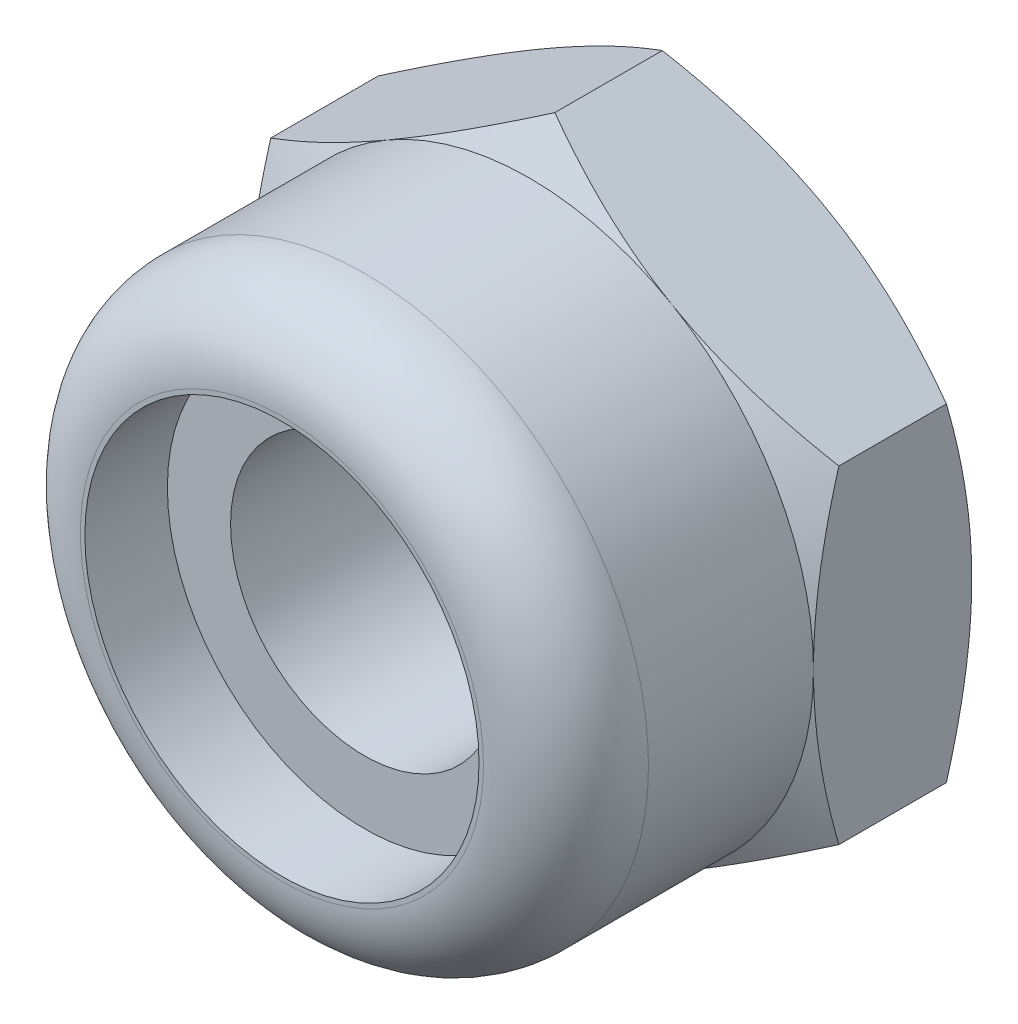
ISO-10303-21;
HEADER;
FILE_DESCRIPTION(('STEP AP214'),'2;1');
FILE_NAME('part.step','',(''),(''),'','','');
FILE_SCHEMA(('AUTOMOTIVE_DESIGN { 1 0 10303 214 1 1 1 1 }'));
ENDSEC;
DATA;
#1=APPLICATION_CONTEXT('core data for automotive mechanical design processes');
#2=APPLICATION_PROTOCOL_DEFINITION('international standard','automotive_design',2000,#1);
#3=PRODUCT_CONTEXT('',#1,'mechanical');
#4=PRODUCT('Part','Part','',(#3));
#5=PRODUCT_RELATED_PRODUCT_CATEGORY('part','',(#4));
#6=PRODUCT_DEFINITION_FORMATION('','',#4);
#7=PRODUCT_DEFINITION_CONTEXT('part definition',#1,'design');
#8=PRODUCT_DEFINITION('design','',#6,#7);
#9=PRODUCT_DEFINITION_SHAPE('','',#8);
#10=(LENGTH_UNIT() NAMED_UNIT(*) SI_UNIT(.MILLI.,.METRE.));
#11=(NAMED_UNIT(*) PLANE_ANGLE_UNIT() SI_UNIT($,.RADIAN.));
#12=(NAMED_UNIT(*) SI_UNIT($,.STERADIAN.) SOLID_ANGLE_UNIT());
#13=UNCERTAINTY_MEASURE_WITH_UNIT(LENGTH_MEASURE(1.E-05),#10,'distance_accuracy_value','');
#14=(GEOMETRIC_REPRESENTATION_CONTEXT(3) GLOBAL_UNCERTAINTY_ASSIGNED_CONTEXT((#13)) GLOBAL_UNIT_ASSIGNED_CONTEXT((#10,
#11,#12)) REPRESENTATION_CONTEXT('',''));
#15=CARTESIAN_POINT('',(0.,0.,0.));
#16=DIRECTION('',(0.,0.,1.));
#17=DIRECTION('',(1.,0.,0.));
#18=AXIS2_PLACEMENT_3D('',#15,#16,#17);
#19=CARTESIAN_POINT('',(0.,0.,-1.95));
#20=DIRECTION('',(0.,0.,1.));
#21=DIRECTION('',(1.,0.,0.));
#22=AXIS2_PLACEMENT_3D('',#19,#20,#21);
#23=CYLINDRICAL_SURFACE('',#22,1.65);
#24=CARTESIAN_POINT('',(0.,0.,2.03333333333333));
#25=DIRECTION('',(0.,0.,1.));
#26=DIRECTION('',(1.,0.,0.));
#27=AXIS2_PLACEMENT_3D('',#24,#25,#26);
#28=CIRCLE('',#27,1.65);
#29=CARTESIAN_POINT('',(1.65,0.,2.03333333333333));
#30=VERTEX_POINT('',#29);
#31=EDGE_CURVE('E263',#30,#30,#28,.T.);
#32=ORIENTED_EDGE('',*,*,#31,.T.);
#33=EDGE_LOOP('',(#32));
#34=FACE_BOUND('',#33,.T.);
#35=CARTESIAN_POINT('',(0.,0.,-1.67952736162661));
#36=DIRECTION('',(0.,0.,-1.));
#37=DIRECTION('',(-1.,0.,0.));
#38=AXIS2_PLACEMENT_3D('',#35,#36,#37);
#39=CIRCLE('',#38,1.65);
#40=CARTESIAN_POINT('',(-1.65,0.,-1.67952736162661));
#41=VERTEX_POINT('',#40);
#42=EDGE_CURVE('E22',#41,#41,#39,.F.);
#43=ORIENTED_EDGE('',*,*,#42,.F.);
#44=EDGE_LOOP('',(#43));
#45=FACE_BOUND('',#44,.T.);
#46=ADVANCED_FACE('F17',(#34,#45),#23,.F.);
#47=CARTESIAN_POINT('',(0.,4.04145188432739,-1.95));
#48=DIRECTION('',(-0.5,0.866025403784437,0.));
#49=DIRECTION('',(-0.866025403784437,-0.5,0.));
#50=AXIS2_PLACEMENT_3D('',#47,#48,#49);
#51=PLANE('',#50);
#52=DIRECTION('',(0.,0.,1.));
#53=VECTOR('',#52,1.);
#54=CARTESIAN_POINT('',(-3.5,2.02072594216368,-1.95));
#55=LINE('',#54,#53);
#56=CARTESIAN_POINT('',(-3.5,2.02072594216372,-1.63739260883035));
#57=VERTEX_POINT('',#56);
#58=CARTESIAN_POINT('',(-3.5,2.02072594216368,-0.312607391169641));
#59=VERTEX_POINT('',#58);
#60=EDGE_CURVE('E236',#57,#59,#55,.T.);
#61=ORIENTED_EDGE('',*,*,#60,.T.);
#62=CARTESIAN_POINT('',(-3.5002,2.02061047210984,-0.312674060693369));
#63=CARTESIAN_POINT('',(-3.34639282154755,2.10941108799267,-0.261385788989985));
#64=CARTESIAN_POINT('',(-3.19125798916558,2.19897822522909,-0.2147409538162));
#65=CARTESIAN_POINT('',(-2.87830199342322,2.37966345361545,-0.133321875533353));
#66=CARTESIAN_POINT('',(-2.72047526921251,2.47078475532382,-0.0985764355845646));
#67=CARTESIAN_POINT('',(-2.40677778961988,2.65189807961074,-0.0444900271828394));
#68=CARTESIAN_POINT('',(-2.25095530083932,2.741862235454,-0.0247890862603857));
#69=CARTESIAN_POINT('',(-1.93857711279463,2.92221386641056,-0.0012701327372566));
#70=CARTESIAN_POINT('',(-1.78202254896577,3.01260068598001,0.00256735545443518));
#71=CARTESIAN_POINT('',(-1.48949078007901,3.18149398149329,-0.00541530187697774));
#72=CARTESIAN_POINT('',(-1.3534697875421,3.26002573814993,-0.0152754340696097));
#73=CARTESIAN_POINT('',(-1.08231397971101,3.41657761679354,-0.0465264668994083));
#74=CARTESIAN_POINT('',(-0.947180102315319,3.49459719728458,-0.0679280432858025));
#75=CARTESIAN_POINT('',(-0.675465207594815,3.6514718648943,-0.121430407880582));
#76=CARTESIAN_POINT('',(-0.538918580721662,3.73030709667645,-0.153757994445092));
#77=CARTESIAN_POINT('',(-0.267861907055493,3.88680174018325,-0.227128933808001));
#78=CARTESIAN_POINT('',(-0.133348387531457,3.9644631568901,-0.268155046569875));
#79=CARTESIAN_POINT('',(0.000200000000009139,4.04156735438123,-0.312674060693379));
#80=B_SPLINE_CURVE_WITH_KNOTS('',3,(#62,#63,#64,#65,#66,#67,#68,#69,#70,#71,#72,#73,#74,#75,#76,
#77,#78,#79),.UNSPECIFIED.,.F.,.F.,(4,2,2,2,2,2,2,2,4),(0.,0.554793832886253,1.11092123814984,
1.65328467083218,2.19498204478403,2.6666513085086,3.13875761298268,3.62133612600511,
4.10296698719189),.UNSPECIFIED.);
#81=CARTESIAN_POINT('',(-1.75,3.03108891324553,0.));
#82=VERTEX_POINT('',#81);
#83=EDGE_CURVE('E42',#59,#82,#80,.T.);
#84=ORIENTED_EDGE('',*,*,#83,.T.);
#85=CARTESIAN_POINT('',(0.,4.04145188432739,-0.312607391169652));
#86=VERTEX_POINT('',#85);
#87=EDGE_CURVE('E185',#82,#86,#80,.T.);
#88=ORIENTED_EDGE('',*,*,#87,.T.);
#89=DIRECTION('',(0.,0.,1.));
#90=VECTOR('',#89,1.);
#91=CARTESIAN_POINT('',(0.,4.04145188432739,-1.95));
#92=LINE('',#91,#90);
#93=CARTESIAN_POINT('',(0.,4.04145188432739,-1.63739260883035));
#94=VERTEX_POINT('',#93);
#95=EDGE_CURVE('E222',#94,#86,#92,.T.);
#96=ORIENTED_EDGE('',*,*,#95,.F.);
#97=CARTESIAN_POINT('',(-3.5002,2.02061047210984,-1.63732593930663));
#98=CARTESIAN_POINT('',(-3.34639282154755,2.10941108799267,-1.68861421101001));
#99=CARTESIAN_POINT('',(-3.19125798916558,2.19897822522909,-1.7352590461838));
#100=CARTESIAN_POINT('',(-2.87830199342323,2.37966345361545,-1.81667812446665));
#101=CARTESIAN_POINT('',(-2.72047526921251,2.47078475532382,-1.85142356441544));
#102=CARTESIAN_POINT('',(-2.40677778961988,2.65189807961074,-1.90550997281716));
#103=CARTESIAN_POINT('',(-2.25095530083932,2.741862235454,-1.92521091373961));
#104=CARTESIAN_POINT('',(-1.93857711279463,2.92221386641056,-1.94872986726274));
#105=CARTESIAN_POINT('',(-1.78202254896577,3.01260068598,-1.95256735545443));
#106=CARTESIAN_POINT('',(-1.48949078007901,3.18149398149329,-1.94458469812302));
#107=CARTESIAN_POINT('',(-1.3534697875421,3.26002573814993,-1.93472456593039));
#108=CARTESIAN_POINT('',(-1.08231397971101,3.41657761679354,-1.90347353310059));
#109=CARTESIAN_POINT('',(-0.947180102315319,3.49459719728458,-1.8820719567142));
#110=CARTESIAN_POINT('',(-0.675465207594814,3.6514718648943,-1.82856959211942));
#111=CARTESIAN_POINT('',(-0.538918580721662,3.73030709667645,-1.79624200555491));
#112=CARTESIAN_POINT('',(-0.267861907055493,3.88680174018325,-1.722871066192));
#113=CARTESIAN_POINT('',(-0.133348387531457,3.9644631568901,-1.68184495343013));
#114=CARTESIAN_POINT('',(0.000200000000009023,4.04156735438123,-1.63732593930662));
#115=B_SPLINE_CURVE_WITH_KNOTS('',3,(#97,#98,#99,#100,#101,#102,#103,#104,#105,#106,#107,#108,
#109,#110,#111,#112,#113,#114),.UNSPECIFIED.,.F.,.F.,(4,2,2,2,2,2,2,2,4),(0.,0.554793832886253,
1.11092123814984,1.65328467083219,2.19498204478403,2.6666513085086,3.13875761298268,
3.62133612600511,4.10296698719189),.UNSPECIFIED.);
#116=CARTESIAN_POINT('',(-1.75,3.03108891324553,-1.95));
#117=VERTEX_POINT('',#116);
#118=EDGE_CURVE('E238',#117,#94,#115,.T.);
#119=ORIENTED_EDGE('',*,*,#118,.F.);
#120=EDGE_CURVE('E216',#57,#117,#115,.T.);
#121=ORIENTED_EDGE('',*,*,#120,.F.);
#122=EDGE_LOOP('',(#61,#84,#88,#96,#119,#121));
#123=FACE_BOUND('',#122,.T.);
#124=ADVANCED_FACE('F19',(#123),#51,.T.);
#125=CARTESIAN_POINT('',(3.5,2.02072594216367,-1.95));
#126=DIRECTION('',(0.500000000000007,0.866025403784435,0.));
#127=DIRECTION('',(-0.866025403784435,0.500000000000007,0.));
#128=AXIS2_PLACEMENT_3D('',#125,#126,#127);
#129=PLANE('',#128);
#130=ORIENTED_EDGE('',*,*,#95,.T.);
#131=CARTESIAN_POINT('',(-0.000199999999990749,4.04156735438123,-0.31267406069338));
#132=CARTESIAN_POINT('',(0.153607178452458,3.95276673849841,-0.26138578898999));
#133=CARTESIAN_POINT('',(0.308742010834432,3.86319960126199,-0.214740953816203));
#134=CARTESIAN_POINT('',(0.621698006576789,3.68251437287563,-0.133321875533352));
#135=CARTESIAN_POINT('',(0.779524730787504,3.59139307116725,-0.0985764355845644));
#136=CARTESIAN_POINT('',(1.09322221038013,3.41027974688034,-0.0444900271828373));
#137=CARTESIAN_POINT('',(1.2490446991607,3.32031559103708,-0.0247890862603817));
#138=CARTESIAN_POINT('',(1.56142288720538,3.13996396008051,-0.00127013273725413));
#139=CARTESIAN_POINT('',(1.71797745103424,3.04957714051106,0.00256735545443432));
#140=CARTESIAN_POINT('',(2.010509219921,2.88068384499777,-0.00541530187697706));
#141=CARTESIAN_POINT('',(2.14653021245791,2.80215208834113,-0.015275434069605));
#142=CARTESIAN_POINT('',(2.417686020289,2.64560020969752,-0.0465264668993998));
#143=CARTESIAN_POINT('',(2.55281989768469,2.56758062920648,-0.0679280432857943));
#144=CARTESIAN_POINT('',(2.82453479240519,2.41070596159677,-0.121430407880573));
#145=CARTESIAN_POINT('',(2.96108141927834,2.33187072981462,-0.153757994445082));
#146=CARTESIAN_POINT('',(3.2321380929445,2.17537608630781,-0.227128933807989));
#147=CARTESIAN_POINT('',(3.36665161246854,2.09771466960097,-0.268155046569862));
#148=CARTESIAN_POINT('',(3.5002,2.02061047210983,-0.312674060693368));
#149=B_SPLINE_CURVE_WITH_KNOTS('',3,(#131,#132,#133,#134,#135,#136,#137,#138,#139,#140,#141,
#142,#143,#144,#145,#146,#147,#148),.UNSPECIFIED.,.F.,.F.,(4,2,2,2,2,2,2,2,4),(0.,
0.554793832886256,1.11092123814984,1.65328467083219,2.19498204478404,2.66665130850861,
3.13875761298268,3.6213361260051,4.10296698719188),.UNSPECIFIED.);
#150=CARTESIAN_POINT('',(1.75000000000002,3.03108891324552,0.));
#151=VERTEX_POINT('',#150);
#152=EDGE_CURVE('E194',#86,#151,#149,.T.);
#153=ORIENTED_EDGE('',*,*,#152,.T.);
#154=CARTESIAN_POINT('',(3.5,2.02072594216371,-0.312607391169652));
#155=VERTEX_POINT('',#154);
#156=EDGE_CURVE('E186',#151,#155,#149,.T.);
#157=ORIENTED_EDGE('',*,*,#156,.T.);
#158=DIRECTION('',(0.,0.,1.));
#159=VECTOR('',#158,1.);
#160=CARTESIAN_POINT('',(3.5,2.02072594216367,-1.95));
#161=LINE('',#160,#159);
#162=CARTESIAN_POINT('',(3.5,2.02072594216371,-1.63739260883035));
#163=VERTEX_POINT('',#162);
#164=EDGE_CURVE('E226',#163,#155,#161,.T.);
#165=ORIENTED_EDGE('',*,*,#164,.F.);
#166=CARTESIAN_POINT('',(-0.000199999999990734,4.04156735438123,-1.63732593930662));
#167=CARTESIAN_POINT('',(0.153607178452458,3.95276673849841,-1.68861421101001));
#168=CARTESIAN_POINT('',(0.308742010834433,3.86319960126199,-1.7352590461838));
#169=CARTESIAN_POINT('',(0.621698006576789,3.68251437287563,-1.81667812446665));
#170=CARTESIAN_POINT('',(0.779524730787504,3.59139307116725,-1.85142356441544));
#171=CARTESIAN_POINT('',(1.09322221038013,3.41027974688034,-1.90550997281716));
#172=CARTESIAN_POINT('',(1.2490446991607,3.32031559103708,-1.92521091373962));
#173=CARTESIAN_POINT('',(1.56142288720538,3.13996396008051,-1.94872986726275));
#174=CARTESIAN_POINT('',(1.71797745103424,3.04957714051106,-1.95256735545443));
#175=CARTESIAN_POINT('',(2.010509219921,2.88068384499777,-1.94458469812302));
#176=CARTESIAN_POINT('',(2.14653021245791,2.80215208834113,-1.93472456593039));
#177=CARTESIAN_POINT('',(2.417686020289,2.64560020969752,-1.9034735331006));
#178=CARTESIAN_POINT('',(2.55281989768469,2.56758062920648,-1.88207195671421));
#179=CARTESIAN_POINT('',(2.82453479240519,2.41070596159677,-1.82856959211943));
#180=CARTESIAN_POINT('',(2.96108141927834,2.33187072981462,-1.79624200555492));
#181=CARTESIAN_POINT('',(3.2321380929445,2.17537608630781,-1.72287106619201));
#182=CARTESIAN_POINT('',(3.36665161246854,2.09771466960097,-1.68184495343014));
#183=CARTESIAN_POINT('',(3.5002,2.02061047210983,-1.63732593930663));
#184=B_SPLINE_CURVE_WITH_KNOTS('',3,(#166,#167,#168,#169,#170,#171,#172,#173,#174,#175,#176,
#177,#178,#179,#180,#181,#182,#183),.UNSPECIFIED.,.F.,.F.,(4,2,2,2,2,2,2,2,4),(0.,
0.554793832886256,1.11092123814984,1.65328467083219,2.19498204478404,2.66665130850861,
3.13875761298268,3.6213361260051,4.10296698719188),.UNSPECIFIED.);
#185=CARTESIAN_POINT('',(1.75000000000002,3.03108891324552,-1.95));
#186=VERTEX_POINT('',#185);
#187=EDGE_CURVE('E207',#186,#163,#184,.T.);
#188=ORIENTED_EDGE('',*,*,#187,.F.);
#189=EDGE_CURVE('E214',#94,#186,#184,.T.);
#190=ORIENTED_EDGE('',*,*,#189,.F.);
#191=EDGE_LOOP('',(#130,#153,#157,#165,#188,#190));
#192=FACE_BOUND('',#191,.T.);
#193=ADVANCED_FACE('F197',(#192),#129,.T.);
#194=CARTESIAN_POINT('',(3.5,2.02072594216367,-1.95));
#195=DIRECTION('',(-1.,0.,0.));
#196=DIRECTION('',(0.,0.,1.));
#197=AXIS2_PLACEMENT_3D('',#194,#195,#196);
#198=PLANE('',#197);
#199=CARTESIAN_POINT('',(3.5,-5.35926299121409,-1.67484346858558));
#200=CARTESIAN_POINT('',(3.5,-5.20559319908845,-1.60058173692105));
#201=CARTESIAN_POINT('',(3.5,-5.05156008083379,-1.52705822833149));
#202=CARTESIAN_POINT('',(3.5,-4.74257074180714,-1.38190950344753));
#203=CARTESIAN_POINT('',(3.5,-4.5876143668244,-1.31028461582134));
#204=CARTESIAN_POINT('',(3.5,-4.27574500225545,-1.16897765517625));
#205=CARTESIAN_POINT('',(3.5,-4.11882589028195,-1.09930904568017));
#206=CARTESIAN_POINT('',(3.5,-3.80369792903858,-0.962964262242773));
#207=CARTESIAN_POINT('',(3.5,-3.64548914750598,-0.896287932319531));
#208=CARTESIAN_POINT('',(3.5,-3.32556618401858,-0.765931819095079));
#209=CARTESIAN_POINT('',(3.5,-3.16383281219927,-0.702298873688876));
#210=CARTESIAN_POINT('',(3.5,-2.838458409456,-0.580016702089503));
#211=CARTESIAN_POINT('',(3.5,-2.67481716858829,-0.521368030370702));
#212=CARTESIAN_POINT('',(3.5,-2.34570278472052,-0.410630279877031));
#213=CARTESIAN_POINT('',(3.5,-2.18023438248745,-0.358527255435866));
#214=CARTESIAN_POINT('',(3.5,-1.84694522806373,-0.262572936976451));
#215=CARTESIAN_POINT('',(3.5,-1.67912523787533,-0.218719033467166));
#216=CARTESIAN_POINT('',(3.5,-1.34101828610928,-0.141391945584794));
#217=CARTESIAN_POINT('',(3.5,-1.17073068027696,-0.107921525211978));
#218=CARTESIAN_POINT('',(3.5,-0.828102385138511,-0.0536149564320535));
#219=CARTESIAN_POINT('',(3.5,-0.655761694017327,-0.0327788191952394));
#220=CARTESIAN_POINT('',(3.5,-0.311020490924473,-0.00558408650575808));
#221=CARTESIAN_POINT('',(3.5,-0.138627397207282,0.000866163165911198));
#222=CARTESIAN_POINT('',(3.5,0.206038074906514,-0.00105355807794603));
#223=CARTESIAN_POINT('',(3.5,0.378310473023159,-0.00941968196343299));
#224=CARTESIAN_POINT('',(3.5,0.672490555822307,-0.0357688927868917));
#225=CARTESIAN_POINT('',(3.5,0.794722791084072,-0.0503206340384192));
#226=CARTESIAN_POINT('',(3.5,1.03824305430558,-0.0859367340533518));
#227=CARTESIAN_POINT('',(3.5,1.15953093025884,-0.107002119926137));
#228=CARTESIAN_POINT('',(3.5,1.52187914771346,-0.178863187081448));
#229=CARTESIAN_POINT('',(3.5,1.7612410421263,-0.238305275622004));
#230=CARTESIAN_POINT('',(3.5,2.11940971387706,-0.340826814402547));
#231=CARTESIAN_POINT('',(3.5,2.24008344316344,-0.377749699085175));
#232=CARTESIAN_POINT('',(3.5,2.48017139213726,-0.455249007699285));
#233=CARTESIAN_POINT('',(3.5,2.5995864179561,-0.49582291166354));
#234=CARTESIAN_POINT('',(3.5,2.83665760451796,-0.579779986782742));
#235=CARTESIAN_POINT('',(3.5,2.95431988203481,-0.623146060034304));
#236=CARTESIAN_POINT('',(3.5,3.18873153508797,-0.712423559566855));
#237=CARTESIAN_POINT('',(3.5,3.30548051959461,-0.758336014592939));
#238=CARTESIAN_POINT('',(3.5,3.42180736613346,-0.805270380724059));
#239=B_SPLINE_CURVE_WITH_KNOTS('',3,(#199,#200,#201,#202,#203,#204,#205,#206,#207,#208,#209,
#210,#211,#212,#213,#214,#215,#216,#217,#218,#219,#220,#221,#222,#223,#224,#225,#226,#227,#228,
#229,#230,#231,#232,#233,#234,#235,#236,#237,#238),.UNSPECIFIED.,.F.,.F.,(4,2,2,2,2,2,2,2,2,2,2,
2,2,2,2,2,2,2,2,4),(0.,0.512025318465739,1.02413870177436,1.53918270315241,2.05419982499224,
2.57553975872799,3.09693761309354,3.61720506610401,4.13730766217538,4.65754858684366,
5.17778997146963,5.69470725122284,6.21149033452402,6.58059623222333,6.94976036239486,
7.68863804939852,8.0671962166048,8.44549507476762,8.821664612801,9.19798724733411),.UNSPECIFIED.);
#240=CARTESIAN_POINT('',(3.5,-2.02072594216373,-0.312607391169652));
#241=VERTEX_POINT('',#240);
#242=CARTESIAN_POINT('',(3.5,0.,0.));
#243=VERTEX_POINT('',#242);
#244=EDGE_CURVE('E173',#241,#243,#239,.T.);
#245=ORIENTED_EDGE('',*,*,#244,.F.);
#246=DIRECTION('',(0.,0.,1.));
#247=VECTOR('',#246,1.);
#248=CARTESIAN_POINT('',(3.5,-2.02072594216372,-1.95));
#249=LINE('',#248,#247);
#250=CARTESIAN_POINT('',(3.5,-2.02072594216373,-1.63739260883035));
#251=VERTEX_POINT('',#250);
#252=EDGE_CURVE('E229',#251,#241,#249,.T.);
#253=ORIENTED_EDGE('',*,*,#252,.F.);
#254=CARTESIAN_POINT('',(3.5,-5.35926299121409,-0.275156531414422));
#255=CARTESIAN_POINT('',(3.5,-5.20559319908845,-0.349418263078947));
#256=CARTESIAN_POINT('',(3.5,-5.05156008083379,-0.422941771668511));
#257=CARTESIAN_POINT('',(3.5,-4.74257074180714,-0.568090496552467));
#258=CARTESIAN_POINT('',(3.5,-4.5876143668244,-0.639715384178658));
#259=CARTESIAN_POINT('',(3.5,-4.27574500225545,-0.781022344823749));
#260=CARTESIAN_POINT('',(3.5,-4.11882589028195,-0.850690954319828));
#261=CARTESIAN_POINT('',(3.5,-3.80369792903859,-0.987035737757227));
#262=CARTESIAN_POINT('',(3.5,-3.64548914750599,-1.05371206768047));
#263=CARTESIAN_POINT('',(3.5,-3.32556618401858,-1.18406818090492));
#264=CARTESIAN_POINT('',(3.5,-3.16383281219927,-1.24770112631112));
#265=CARTESIAN_POINT('',(3.5,-2.838458409456,-1.3699832979105));
#266=CARTESIAN_POINT('',(3.5,-2.67481716858829,-1.4286319696293));
#267=CARTESIAN_POINT('',(3.5,-2.34570278472052,-1.53936972012297));
#268=CARTESIAN_POINT('',(3.5,-2.18023438248746,-1.59147274456413));
#269=CARTESIAN_POINT('',(3.5,-1.84694522806373,-1.68742706302355));
#270=CARTESIAN_POINT('',(3.5,-1.67912523787533,-1.73128096653283));
#271=CARTESIAN_POINT('',(3.5,-1.34101828610928,-1.8086080544152));
#272=CARTESIAN_POINT('',(3.5,-1.17073068027696,-1.84207847478802));
#273=CARTESIAN_POINT('',(3.5,-0.828102385138511,-1.89638504356795));
#274=CARTESIAN_POINT('',(3.5,-0.655761694017327,-1.91722118080476));
#275=CARTESIAN_POINT('',(3.5,-0.311020490924473,-1.94441591349424));
#276=CARTESIAN_POINT('',(3.5,-0.138627397207282,-1.95086616316591));
#277=CARTESIAN_POINT('',(3.5,0.206038074906514,-1.94894644192205));
#278=CARTESIAN_POINT('',(3.5,0.378310473023159,-1.94058031803657));
#279=CARTESIAN_POINT('',(3.5,0.672490555822307,-1.91423110721311));
#280=CARTESIAN_POINT('',(3.5,0.794722791084072,-1.89967936596158));
#281=CARTESIAN_POINT('',(3.5,1.03824305430558,-1.86406326594665));
#282=CARTESIAN_POINT('',(3.5,1.15953093025884,-1.84299788007386));
#283=CARTESIAN_POINT('',(3.5,1.52187914771346,-1.77113681291855));
#284=CARTESIAN_POINT('',(3.5,1.7612410421263,-1.711694724378));
#285=CARTESIAN_POINT('',(3.5,2.11940971387706,-1.60917318559745));
#286=CARTESIAN_POINT('',(3.5,2.24008344316344,-1.57225030091483));
#287=CARTESIAN_POINT('',(3.5,2.48017139213726,-1.49475099230072));
#288=CARTESIAN_POINT('',(3.5,2.5995864179561,-1.45417708833646));
#289=CARTESIAN_POINT('',(3.5,2.83665760451796,-1.37022001321726));
#290=CARTESIAN_POINT('',(3.5,2.95431988203481,-1.3268539399657));
#291=CARTESIAN_POINT('',(3.5,3.18873153508797,-1.23757644043315));
#292=CARTESIAN_POINT('',(3.5,3.30548051959461,-1.19166398540706));
#293=CARTESIAN_POINT('',(3.5,3.42180736613346,-1.14472961927594));
#294=B_SPLINE_CURVE_WITH_KNOTS('',3,(#254,#255,#256,#257,#258,#259,#260,#261,#262,#263,#264,
#265,#266,#267,#268,#269,#270,#271,#272,#273,#274,#275,#276,#277,#278,#279,#280,#281,#282,#283,
#284,#285,#286,#287,#288,#289,#290,#291,#292,#293),.UNSPECIFIED.,.F.,.F.,(4,2,2,2,2,2,2,2,2,2,2,
2,2,2,2,2,2,2,2,4),(0.,0.512025318465738,1.02413870177436,1.53918270315241,2.05419982499224,
2.57553975872798,3.09693761309353,3.61720506610401,4.13730766217538,4.65754858684366,
5.17778997146963,5.69470725122284,6.21149033452402,6.58059623222333,6.94976036239486,
7.68863804939852,8.06719621660479,8.44549507476762,8.821664612801,9.19798724733411),.UNSPECIFIED.);
#295=CARTESIAN_POINT('',(3.5,0.,-1.95));
#296=VERTEX_POINT('',#295);
#297=EDGE_CURVE('E359',#251,#296,#294,.T.);
#298=ORIENTED_EDGE('',*,*,#297,.T.);
#299=EDGE_CURVE('E215',#296,#163,#294,.T.);
#300=ORIENTED_EDGE('',*,*,#299,.T.);
#301=ORIENTED_EDGE('',*,*,#164,.T.);
#302=EDGE_CURVE('E184',#243,#155,#239,.T.);
#303=ORIENTED_EDGE('',*,*,#302,.F.);
#304=EDGE_LOOP('',(#245,#253,#298,#300,#301,#303));
#305=FACE_BOUND('',#304,.T.);
#306=ADVANCED_FACE('F201',(#305),#198,.F.);
#307=CARTESIAN_POINT('',(0.,-4.04145188432743,-1.95));
#308=DIRECTION('',(0.5,-0.866025403784437,0.));
#309=DIRECTION('',(0.866025403784437,0.5,0.));
#310=AXIS2_PLACEMENT_3D('',#307,#308,#309);
#311=PLANE('',#310);
#312=ORIENTED_EDGE('',*,*,#252,.T.);
#313=CARTESIAN_POINT('',(3.5002,-2.02061047210988,-0.312674060693383));
#314=CARTESIAN_POINT('',(3.34639282154755,-2.10941108799271,-0.261385788989999));
#315=CARTESIAN_POINT('',(3.19125798916558,-2.19897822522914,-0.214740953816215));
#316=CARTESIAN_POINT('',(2.87830199342322,-2.3796634536155,-0.133321875533369));
#317=CARTESIAN_POINT('',(2.72047526921251,-2.47078475532387,-0.0985764355845818));
#318=CARTESIAN_POINT('',(2.40677778961988,-2.65189807961078,-0.0444900271828582));
#319=CARTESIAN_POINT('',(2.25095530083931,-2.74186223545404,-0.0247890862604051));
#320=CARTESIAN_POINT('',(1.93857711279463,-2.9222138664106,-0.00127013273727776));
#321=CARTESIAN_POINT('',(1.78202254896577,-3.01260068598005,0.00256735545441286));
#322=CARTESIAN_POINT('',(1.48949078007901,-3.18149398149334,-0.00541530187700159));
#323=CARTESIAN_POINT('',(1.35346978754209,-3.26002573814998,-0.0152754340696339));
#324=CARTESIAN_POINT('',(1.08231397971101,-3.41657761679359,-0.0465264668994331));
#325=CARTESIAN_POINT('',(0.947180102315317,-3.49459719728463,-0.0679280432858276));
#326=CARTESIAN_POINT('',(0.675465207594815,-3.65147186489434,-0.121430407880607));
#327=CARTESIAN_POINT('',(0.538918580721663,-3.73030709667649,-0.153757994445117));
#328=CARTESIAN_POINT('',(0.267861907055497,-3.8868017401833,-0.227128933808026));
#329=CARTESIAN_POINT('',(0.133348387531462,-3.96446315689014,-0.268155046569899));
#330=CARTESIAN_POINT('',(-0.000200000000001401,-4.04156735438127,-0.312674060693403));
#331=B_SPLINE_CURVE_WITH_KNOTS('',3,(#313,#314,#315,#316,#317,#318,#319,#320,#321,#322,#323,
#324,#325,#326,#327,#328,#329,#330),.UNSPECIFIED.,.F.,.F.,(4,2,2,2,2,2,2,2,4),(0.,
0.554793832886255,1.11092123814984,1.65328467083219,2.19498204478404,2.66665130850861,
3.13875761298268,3.6213361260051,4.10296698719188),.UNSPECIFIED.);
#332=CARTESIAN_POINT('',(1.75,-3.03108891324552,0.));
#333=VERTEX_POINT('',#332);
#334=EDGE_CURVE('E353',#241,#333,#331,.T.);
#335=ORIENTED_EDGE('',*,*,#334,.T.);
#336=CARTESIAN_POINT('',(0.,-4.04145188432739,-0.312607391169652));
#337=VERTEX_POINT('',#336);
#338=EDGE_CURVE('E166',#333,#337,#331,.T.);
#339=ORIENTED_EDGE('',*,*,#338,.T.);
#340=DIRECTION('',(0.,0.,1.));
#341=VECTOR('',#340,1.);
#342=CARTESIAN_POINT('',(0.,-4.04145188432743,-1.95));
#343=LINE('',#342,#341);
#344=CARTESIAN_POINT('',(0.,-4.04145188432739,-1.63739260883035));
#345=VERTEX_POINT('',#344);
#346=EDGE_CURVE('E232',#345,#337,#343,.T.);
#347=ORIENTED_EDGE('',*,*,#346,.F.);
#348=CARTESIAN_POINT('',(3.5002,-2.02061047210988,-1.63732593930662));
#349=CARTESIAN_POINT('',(3.34639282154755,-2.10941108799271,-1.68861421101));
#350=CARTESIAN_POINT('',(3.19125798916558,-2.19897822522914,-1.73525904618379));
#351=CARTESIAN_POINT('',(2.87830199342322,-2.3796634536155,-1.81667812446663));
#352=CARTESIAN_POINT('',(2.72047526921251,-2.47078475532387,-1.85142356441542));
#353=CARTESIAN_POINT('',(2.40677778961988,-2.65189807961078,-1.90550997281714));
#354=CARTESIAN_POINT('',(2.25095530083931,-2.74186223545404,-1.92521091373959));
#355=CARTESIAN_POINT('',(1.93857711279463,-2.9222138664106,-1.94872986726272));
#356=CARTESIAN_POINT('',(1.78202254896577,-3.01260068598005,-1.95256735545441));
#357=CARTESIAN_POINT('',(1.48949078007901,-3.18149398149334,-1.944584698123));
#358=CARTESIAN_POINT('',(1.35346978754209,-3.26002573814998,-1.93472456593037));
#359=CARTESIAN_POINT('',(1.08231397971101,-3.41657761679359,-1.90347353310057));
#360=CARTESIAN_POINT('',(0.947180102315317,-3.49459719728463,-1.88207195671417));
#361=CARTESIAN_POINT('',(0.675465207594815,-3.65147186489434,-1.82856959211939));
#362=CARTESIAN_POINT('',(0.538918580721663,-3.73030709667649,-1.79624200555488));
#363=CARTESIAN_POINT('',(0.267861907055496,-3.8868017401833,-1.72287106619197));
#364=CARTESIAN_POINT('',(0.133348387531462,-3.96446315689014,-1.6818449534301));
#365=CARTESIAN_POINT('',(-0.000200000000001409,-4.04156735438127,-1.6373259393066));
#366=B_SPLINE_CURVE_WITH_KNOTS('',3,(#348,#349,#350,#351,#352,#353,#354,#355,#356,#357,#358,
#359,#360,#361,#362,#363,#364,#365),.UNSPECIFIED.,.F.,.F.,(4,2,2,2,2,2,2,2,4),(0.,
0.554793832886254,1.11092123814984,1.65328467083219,2.19498204478404,2.66665130850861,
3.13875761298268,3.62133612600511,4.10296698719188),.UNSPECIFIED.);
#367=CARTESIAN_POINT('',(1.75,-3.03108891324553,-1.95));
#368=VERTEX_POINT('',#367);
#369=EDGE_CURVE('E329',#368,#345,#366,.T.);
#370=ORIENTED_EDGE('',*,*,#369,.F.);
#371=EDGE_CURVE('E355',#251,#368,#366,.T.);
#372=ORIENTED_EDGE('',*,*,#371,.F.);
#373=EDGE_LOOP('',(#312,#335,#339,#347,#370,#372));
#374=FACE_BOUND('',#373,.T.);
#375=ADVANCED_FACE('F337',(#374),#311,.T.);
#376=CARTESIAN_POINT('',(-3.5,-2.02072594216371,-1.95));
#377=DIRECTION('',(-0.500000000000006,-0.866025403784435,0.));
#378=DIRECTION('',(0.866025403784435,-0.500000000000006,0.));
#379=AXIS2_PLACEMENT_3D('',#376,#377,#378);
#380=PLANE('',#379);
#381=ORIENTED_EDGE('',*,*,#346,.T.);
#382=CARTESIAN_POINT('',(0.000199999999998716,-4.04156735438127,-0.312674060693404));
#383=CARTESIAN_POINT('',(-0.153607178452453,-3.95276673849845,-0.261385788990015));
#384=CARTESIAN_POINT('',(-0.308742010834428,-3.86319960126203,-0.214740953816227));
#385=CARTESIAN_POINT('',(-0.621698006576788,-3.68251437287567,-0.133321875533377));
#386=CARTESIAN_POINT('',(-0.779524730787504,-3.59139307116729,-0.0985764355845882));
#387=CARTESIAN_POINT('',(-1.09322221038014,-3.41027974688038,-0.0444900271828605));
#388=CARTESIAN_POINT('',(-1.2490446991607,-3.32031559103712,-0.0247890862604047));
#389=CARTESIAN_POINT('',(-1.56142288720539,-3.13996396008055,-0.00127013273727516));
#390=CARTESIAN_POINT('',(-1.71797745103425,-3.04957714051109,0.00256735545441514));
#391=CARTESIAN_POINT('',(-2.01050921992101,-2.8806838449978,-0.00541530187699614));
#392=CARTESIAN_POINT('',(-2.14653021245792,-2.80215208834117,-0.0152754340696252));
#393=CARTESIAN_POINT('',(-2.41768602028901,-2.64560020969756,-0.0465264668994201));
#394=CARTESIAN_POINT('',(-2.55281989768469,-2.56758062920652,-0.0679280432858135));
#395=CARTESIAN_POINT('',(-2.82453479240519,-2.41070596159681,-0.12143040788059));
#396=CARTESIAN_POINT('',(-2.96108141927834,-2.33187072981466,-0.153757994445099));
#397=CARTESIAN_POINT('',(-3.23213809294451,-2.17537608630785,-0.227128933808004));
#398=CARTESIAN_POINT('',(-3.36665161246854,-2.09771466960101,-0.268155046569875));
#399=CARTESIAN_POINT('',(-3.5002,-2.02061047210988,-0.312674060693378));
#400=B_SPLINE_CURVE_WITH_KNOTS('',3,(#382,#383,#384,#385,#386,#387,#388,#389,#390,#391,#392,
#393,#394,#395,#396,#397,#398,#399),.UNSPECIFIED.,.F.,.F.,(4,2,2,2,2,2,2,2,4),(0.,
0.554793832886261,1.11092123814985,1.65328467083221,2.19498204478406,2.66665130850862,
3.13875761298269,3.62133612600512,4.10296698719189),.UNSPECIFIED.);
#401=CARTESIAN_POINT('',(-1.75,-3.03108891324552,0.));
#402=VERTEX_POINT('',#401);
#403=EDGE_CURVE('E133',#337,#402,#400,.T.);
#404=ORIENTED_EDGE('',*,*,#403,.T.);
#405=CARTESIAN_POINT('',(-3.5,-2.02072594216372,-0.312607391169652));
#406=VERTEX_POINT('',#405);
#407=EDGE_CURVE('E124',#402,#406,#400,.T.);
#408=ORIENTED_EDGE('',*,*,#407,.T.);
#409=DIRECTION('',(0.,0.,1.));
#410=VECTOR('',#409,1.);
#411=CARTESIAN_POINT('',(-3.5,-2.02072594216371,-1.95));
#412=LINE('',#411,#410);
#413=CARTESIAN_POINT('',(-3.5,-2.02072594216372,-1.63739260883035));
#414=VERTEX_POINT('',#413);
#415=EDGE_CURVE('E132',#414,#406,#412,.T.);
#416=ORIENTED_EDGE('',*,*,#415,.F.);
#417=CARTESIAN_POINT('',(0.00019999999999873,-4.04156735438127,-1.6373259393066));
#418=CARTESIAN_POINT('',(-0.153607178452452,-3.95276673849845,-1.68861421100998));
#419=CARTESIAN_POINT('',(-0.308742010834428,-3.86319960126203,-1.73525904618377));
#420=CARTESIAN_POINT('',(-0.621698006576788,-3.68251437287567,-1.81667812446662));
#421=CARTESIAN_POINT('',(-0.779524730787504,-3.59139307116729,-1.85142356441541));
#422=CARTESIAN_POINT('',(-1.09322221038014,-3.41027974688038,-1.90550997281714));
#423=CARTESIAN_POINT('',(-1.2490446991607,-3.32031559103712,-1.92521091373959));
#424=CARTESIAN_POINT('',(-1.56142288720539,-3.13996396008055,-1.94872986726273));
#425=CARTESIAN_POINT('',(-1.71797745103425,-3.04957714051109,-1.95256735545442));
#426=CARTESIAN_POINT('',(-2.01050921992101,-2.8806838449978,-1.94458469812301));
#427=CARTESIAN_POINT('',(-2.14653021245792,-2.80215208834117,-1.93472456593038));
#428=CARTESIAN_POINT('',(-2.41768602028901,-2.64560020969756,-1.90347353310058));
#429=CARTESIAN_POINT('',(-2.55281989768469,-2.56758062920652,-1.88207195671419));
#430=CARTESIAN_POINT('',(-2.82453479240519,-2.41070596159681,-1.82856959211941));
#431=CARTESIAN_POINT('',(-2.96108141927834,-2.33187072981466,-1.7962420055549));
#432=CARTESIAN_POINT('',(-3.23213809294451,-2.17537608630785,-1.722871066192));
#433=CARTESIAN_POINT('',(-3.36665161246854,-2.09771466960101,-1.68184495343012));
#434=CARTESIAN_POINT('',(-3.5002,-2.02061047210988,-1.63732593930662));
#435=B_SPLINE_CURVE_WITH_KNOTS('',3,(#417,#418,#419,#420,#421,#422,#423,#424,#425,#426,#427,
#428,#429,#430,#431,#432,#433,#434),.UNSPECIFIED.,.F.,.F.,(4,2,2,2,2,2,2,2,4),(0.,
0.554793832886261,1.11092123814985,1.65328467083221,2.19498204478406,2.66665130850863,
3.13875761298269,3.62133612600512,4.10296698719189),.UNSPECIFIED.);
#436=CARTESIAN_POINT('',(-1.75,-3.03108891324552,-1.95));
#437=VERTEX_POINT('',#436);
#438=EDGE_CURVE('E316',#437,#414,#435,.T.);
#439=ORIENTED_EDGE('',*,*,#438,.F.);
#440=EDGE_CURVE('E328',#345,#437,#435,.T.);
#441=ORIENTED_EDGE('',*,*,#440,.F.);
#442=EDGE_LOOP('',(#381,#404,#408,#416,#439,#441));
#443=FACE_BOUND('',#442,.T.);
#444=ADVANCED_FACE('F334',(#443),#380,.T.);
#445=CARTESIAN_POINT('',(-3.5,2.02072594216368,-1.95));
#446=DIRECTION('',(-1.,0.,0.));
#447=DIRECTION('',(0.,0.,1.));
#448=AXIS2_PLACEMENT_3D('',#445,#446,#447);
#449=PLANE('',#448);
#450=ORIENTED_EDGE('',*,*,#415,.T.);
#451=CARTESIAN_POINT('',(-3.5,-5.35926299121408,-1.67484346858557));
#452=CARTESIAN_POINT('',(-3.5,-5.20559319908844,-1.60058173692105));
#453=CARTESIAN_POINT('',(-3.5,-5.05156008083378,-1.52705822833148));
#454=CARTESIAN_POINT('',(-3.5,-4.74257074180712,-1.38190950344753));
#455=CARTESIAN_POINT('',(-3.5,-4.58761436682439,-1.31028461582134));
#456=CARTESIAN_POINT('',(-3.5,-4.27574500225545,-1.16897765517625));
#457=CARTESIAN_POINT('',(-3.5,-4.11882589028194,-1.09930904568017));
#458=CARTESIAN_POINT('',(-3.5,-3.80369792903858,-0.96296426224277));
#459=CARTESIAN_POINT('',(-3.5,-3.64548914750598,-0.896287932319527));
#460=CARTESIAN_POINT('',(-3.5,-3.32556618401858,-0.765931819095075));
#461=CARTESIAN_POINT('',(-3.5,-3.16383281219926,-0.702298873688873));
#462=CARTESIAN_POINT('',(-3.5,-2.838458409456,-0.5800167020895));
#463=CARTESIAN_POINT('',(-3.5,-2.67481716858828,-0.521368030370698));
#464=CARTESIAN_POINT('',(-3.5,-2.34570278472051,-0.410630279877028));
#465=CARTESIAN_POINT('',(-3.5,-2.18023438248744,-0.358527255435863));
#466=CARTESIAN_POINT('',(-3.5,-1.84694522806372,-0.262572936976448));
#467=CARTESIAN_POINT('',(-3.5,-1.67912523787532,-0.218719033467163));
#468=CARTESIAN_POINT('',(-3.5,-1.34101828610927,-0.14139194558479));
#469=CARTESIAN_POINT('',(-3.5,-1.17073068027695,-0.107921525211976));
#470=CARTESIAN_POINT('',(-3.5,-0.828102385138502,-0.0536149564320528));
#471=CARTESIAN_POINT('',(-3.5,-0.655761694017319,-0.0327788191952384));
#472=CARTESIAN_POINT('',(-3.5,-0.311020490924466,-0.00558408650575762));
#473=CARTESIAN_POINT('',(-3.5,-0.138627397207275,0.000866163165910831));
#474=CARTESIAN_POINT('',(-3.5,0.20603807490652,-0.00105355807794567));
#475=CARTESIAN_POINT('',(-3.5,0.378310473023165,-0.00941968196343104));
#476=CARTESIAN_POINT('',(-3.5,0.672490555822312,-0.0357688927868905));
#477=CARTESIAN_POINT('',(-3.5,0.794722791084076,-0.0503206340384195));
#478=CARTESIAN_POINT('',(-3.5,1.03824305430558,-0.085936734053353));
#479=CARTESIAN_POINT('',(-3.5,1.15953093025885,-0.107002119926138));
#480=CARTESIAN_POINT('',(-3.5,1.52187914771346,-0.178863187081448));
#481=CARTESIAN_POINT('',(-3.5,1.7612410421263,-0.238305275622005));
#482=CARTESIAN_POINT('',(-3.5,2.11940971387706,-0.340826814402548));
#483=CARTESIAN_POINT('',(-3.5,2.24008344316344,-0.377749699085176));
#484=CARTESIAN_POINT('',(-3.5,2.48017139213726,-0.455249007699286));
#485=CARTESIAN_POINT('',(-3.5,2.59958641795611,-0.495822911663542));
#486=CARTESIAN_POINT('',(-3.5,2.83665760451796,-0.579779986782744));
#487=CARTESIAN_POINT('',(-3.5,2.95431988203481,-0.623146060034306));
#488=CARTESIAN_POINT('',(-3.5,3.18873153508798,-0.712423559566857));
#489=CARTESIAN_POINT('',(-3.5,3.30548051959462,-0.75833601459294));
#490=CARTESIAN_POINT('',(-3.5,3.42180736613347,-0.805270380724061));
#491=B_SPLINE_CURVE_WITH_KNOTS('',3,(#451,#452,#453,#454,#455,#456,#457,#458,#459,#460,#461,
#462,#463,#464,#465,#466,#467,#468,#469,#470,#471,#472,#473,#474,#475,#476,#477,#478,#479,#480,
#481,#482,#483,#484,#485,#486,#487,#488,#489,#490),.UNSPECIFIED.,.F.,.F.,(4,2,2,2,2,2,2,2,2,2,2,
2,2,2,2,2,2,2,2,4),(0.,0.512025318465738,1.02413870177436,1.53918270315241,2.05419982499223,
2.57553975872798,3.09693761309353,3.61720506610401,4.13730766217538,4.65754858684365,
5.17778997146962,5.69470725122283,6.21149033452402,6.58059623222332,6.94976036239485,
7.68863804939851,8.06719621660479,8.44549507476761,8.82166461280099,9.1979872473341),.UNSPECIFIED.);
#492=CARTESIAN_POINT('',(-3.5,0.,0.));
#493=VERTEX_POINT('',#492);
#494=EDGE_CURVE('E117',#406,#493,#491,.T.);
#495=ORIENTED_EDGE('',*,*,#494,.T.);
#496=EDGE_CURVE('E111',#493,#59,#491,.T.);
#497=ORIENTED_EDGE('',*,*,#496,.T.);
#498=ORIENTED_EDGE('',*,*,#60,.F.);
#499=CARTESIAN_POINT('',(-3.5,-5.35926299121408,-0.275156531414431));
#500=CARTESIAN_POINT('',(-3.5,-5.20559319908844,-0.349418263078955));
#501=CARTESIAN_POINT('',(-3.5,-5.05156008083378,-0.422941771668518));
#502=CARTESIAN_POINT('',(-3.5,-4.74257074180712,-0.568090496552472));
#503=CARTESIAN_POINT('',(-3.5,-4.58761436682439,-0.639715384178663));
#504=CARTESIAN_POINT('',(-3.5,-4.27574500225544,-0.781022344823753));
#505=CARTESIAN_POINT('',(-3.5,-4.11882589028194,-0.850690954319833));
#506=CARTESIAN_POINT('',(-3.5,-3.80369792903857,-0.987035737757231));
#507=CARTESIAN_POINT('',(-3.5,-3.64548914750597,-1.05371206768047));
#508=CARTESIAN_POINT('',(-3.5,-3.32556618401857,-1.18406818090492));
#509=CARTESIAN_POINT('',(-3.5,-3.16383281219926,-1.24770112631113));
#510=CARTESIAN_POINT('',(-3.5,-2.83845840945599,-1.3699832979105));
#511=CARTESIAN_POINT('',(-3.5,-2.67481716858828,-1.4286319696293));
#512=CARTESIAN_POINT('',(-3.5,-2.34570278472051,-1.53936972012297));
#513=CARTESIAN_POINT('',(-3.5,-2.18023438248744,-1.59147274456414));
#514=CARTESIAN_POINT('',(-3.5,-1.84694522806372,-1.68742706302355));
#515=CARTESIAN_POINT('',(-3.5,-1.67912523787532,-1.73128096653284));
#516=CARTESIAN_POINT('',(-3.5,-1.34101828610927,-1.80860805441521));
#517=CARTESIAN_POINT('',(-3.5,-1.17073068027695,-1.84207847478802));
#518=CARTESIAN_POINT('',(-3.5,-0.828102385138502,-1.89638504356795));
#519=CARTESIAN_POINT('',(-3.5,-0.655761694017319,-1.91722118080476));
#520=CARTESIAN_POINT('',(-3.5,-0.311020490924466,-1.94441591349424));
#521=CARTESIAN_POINT('',(-3.5,-0.138627397207276,-1.95086616316591));
#522=CARTESIAN_POINT('',(-3.5,0.206038074906519,-1.94894644192205));
#523=CARTESIAN_POINT('',(-3.5,0.378310473023164,-1.94058031803657));
#524=CARTESIAN_POINT('',(-3.5,0.672490555822312,-1.91423110721311));
#525=CARTESIAN_POINT('',(-3.5,0.794722791084076,-1.89967936596158));
#526=CARTESIAN_POINT('',(-3.5,1.03824305430558,-1.86406326594665));
#527=CARTESIAN_POINT('',(-3.5,1.15953093025885,-1.84299788007386));
#528=CARTESIAN_POINT('',(-3.5,1.52187914771346,-1.77113681291855));
#529=CARTESIAN_POINT('',(-3.5,1.7612410421263,-1.711694724378));
#530=CARTESIAN_POINT('',(-3.5,2.11940971387706,-1.60917318559745));
#531=CARTESIAN_POINT('',(-3.5,2.24008344316344,-1.57225030091482));
#532=CARTESIAN_POINT('',(-3.5,2.48017139213726,-1.49475099230071));
#533=CARTESIAN_POINT('',(-3.5,2.59958641795611,-1.45417708833646));
#534=CARTESIAN_POINT('',(-3.5,2.83665760451796,-1.37022001321726));
#535=CARTESIAN_POINT('',(-3.5,2.95431988203481,-1.3268539399657));
#536=CARTESIAN_POINT('',(-3.5,3.18873153508798,-1.23757644043314));
#537=CARTESIAN_POINT('',(-3.5,3.30548051959462,-1.19166398540706));
#538=CARTESIAN_POINT('',(-3.5,3.42180736613347,-1.14472961927594));
#539=B_SPLINE_CURVE_WITH_KNOTS('',3,(#499,#500,#501,#502,#503,#504,#505,#506,#507,#508,#509,
#510,#511,#512,#513,#514,#515,#516,#517,#518,#519,#520,#521,#522,#523,#524,#525,#526,#527,#528,
#529,#530,#531,#532,#533,#534,#535,#536,#537,#538),.UNSPECIFIED.,.F.,.F.,(4,2,2,2,2,2,2,2,2,2,2,
2,2,2,2,2,2,2,2,4),(0.,0.512025318465738,1.02413870177436,1.53918270315241,2.05419982499224,
2.57553975872798,3.09693761309353,3.61720506610401,4.13730766217538,4.65754858684365,
5.17778997146962,5.69470725122283,6.21149033452402,6.58059623222332,6.94976036239485,
7.68863804939852,8.06719621660479,8.44549507476761,8.82166461280099,9.1979872473341),.UNSPECIFIED.);
#540=CARTESIAN_POINT('',(-3.5,0.,-1.95));
#541=VERTEX_POINT('',#540);
#542=EDGE_CURVE('E312',#541,#57,#539,.T.);
#543=ORIENTED_EDGE('',*,*,#542,.F.);
#544=EDGE_CURVE('E314',#414,#541,#539,.T.);
#545=ORIENTED_EDGE('',*,*,#544,.F.);
#546=EDGE_LOOP('',(#450,#495,#497,#498,#543,#545));
#547=FACE_BOUND('',#546,.T.);
#548=ADVANCED_FACE('F129',(#547),#449,.T.);
#549=CARTESIAN_POINT('',(0.,4.04145188432739,-1.95));
#550=DIRECTION('',(0.,0.,-1.));
#551=DIRECTION('',(-1.,0.,0.));
#552=AXIS2_PLACEMENT_3D('',#549,#550,#551);
#553=PLANE('',#552);
#554=CARTESIAN_POINT('',(0.,0.,-1.95));
#555=DIRECTION('',(0.,0.,-1.));
#556=DIRECTION('',(-1.,0.,0.));
#557=AXIS2_PLACEMENT_3D('',#554,#555,#556);
#558=CIRCLE('',#557,2.);
#559=CARTESIAN_POINT('',(-2.,0.,-1.95));
#560=VERTEX_POINT('',#559);
#561=EDGE_CURVE('E241',#560,#560,#558,.F.);
#562=ORIENTED_EDGE('',*,*,#561,.T.);
#563=EDGE_LOOP('',(#562));
#564=FACE_BOUND('',#563,.T.);
#565=CARTESIAN_POINT('',(0.,0.,-1.95));
#566=DIRECTION('',(0.,0.,-1.));
#567=DIRECTION('',(-1.,0.,0.));
#568=AXIS2_PLACEMENT_3D('',#565,#566,#567);
#569=CIRCLE('',#568,3.5);
#570=EDGE_CURVE('E127',#541,#437,#569,.F.);
#571=ORIENTED_EDGE('',*,*,#570,.F.);
#572=EDGE_CURVE('E225',#117,#541,#569,.F.);
#573=ORIENTED_EDGE('',*,*,#572,.F.);
#574=EDGE_CURVE('E240',#186,#117,#569,.F.);
#575=ORIENTED_EDGE('',*,*,#574,.F.);
#576=CARTESIAN_POINT('',(0.,0.,-1.95));
#577=DIRECTION('',(0.,0.,1.));
#578=DIRECTION('',(1.,0.,0.));
#579=AXIS2_PLACEMENT_3D('',#576,#577,#578);
#580=CIRCLE('',#579,3.5);
#581=EDGE_CURVE('E195',#296,#186,#580,.T.);
#582=ORIENTED_EDGE('',*,*,#581,.F.);
#583=EDGE_CURVE('E392',#368,#296,#569,.F.);
#584=ORIENTED_EDGE('',*,*,#583,.F.);
#585=EDGE_CURVE('E384',#437,#368,#569,.F.);
#586=ORIENTED_EDGE('',*,*,#585,.F.);
#587=EDGE_LOOP('',(#571,#573,#575,#582,#584,#586));
#588=FACE_BOUND('',#587,.T.);
#589=ADVANCED_FACE('F203',(#564,#588),#553,.T.);
#590=CARTESIAN_POINT('',(0.,0.,-1.95));
#591=DIRECTION('',(0.,0.,1.));
#592=DIRECTION('',(1.,0.,0.));
#593=AXIS2_PLACEMENT_3D('',#590,#591,#592);
#594=CONICAL_SURFACE('',#593,3.5,1.0471975511966);
#595=ORIENTED_EDGE('',*,*,#120,.T.);
#596=ORIENTED_EDGE('',*,*,#572,.T.);
#597=ORIENTED_EDGE('',*,*,#542,.T.);
#598=EDGE_LOOP('',(#595,#596,#597));
#599=FACE_BOUND('',#598,.T.);
#600=ADVANCED_FACE('F403',(#599),#594,.T.);
#601=ORIENTED_EDGE('',*,*,#118,.T.);
#602=ORIENTED_EDGE('',*,*,#189,.T.);
#603=ORIENTED_EDGE('',*,*,#574,.T.);
#604=EDGE_LOOP('',(#601,#602,#603));
#605=FACE_BOUND('',#604,.T.);
#606=ADVANCED_FACE('F401',(#605),#594,.T.);
#607=ORIENTED_EDGE('',*,*,#187,.T.);
#608=ORIENTED_EDGE('',*,*,#299,.F.);
#609=ORIENTED_EDGE('',*,*,#581,.T.);
#610=EDGE_LOOP('',(#607,#608,#609));
#611=FACE_BOUND('',#610,.T.);
#612=ADVANCED_FACE('F411',(#611),#594,.T.);
#613=ORIENTED_EDGE('',*,*,#371,.T.);
#614=ORIENTED_EDGE('',*,*,#583,.T.);
#615=ORIENTED_EDGE('',*,*,#297,.F.);
#616=EDGE_LOOP('',(#613,#614,#615));
#617=FACE_BOUND('',#616,.T.);
#618=ADVANCED_FACE('F405',(#617),#594,.T.);
#619=ORIENTED_EDGE('',*,*,#369,.T.);
#620=ORIENTED_EDGE('',*,*,#440,.T.);
#621=ORIENTED_EDGE('',*,*,#585,.T.);
#622=EDGE_LOOP('',(#619,#620,#621));
#623=FACE_BOUND('',#622,.T.);
#624=ADVANCED_FACE('F382',(#623),#594,.T.);
#625=ORIENTED_EDGE('',*,*,#438,.T.);
#626=ORIENTED_EDGE('',*,*,#544,.T.);
#627=ORIENTED_EDGE('',*,*,#570,.T.);
#628=EDGE_LOOP('',(#625,#626,#627));
#629=FACE_BOUND('',#628,.T.);
#630=ADVANCED_FACE('F154',(#629),#594,.T.);
#631=CARTESIAN_POINT('',(0.,0.,0.));
#632=DIRECTION('',(0.,0.,-1.));
#633=DIRECTION('',(-1.,0.,0.));
#634=AXIS2_PLACEMENT_3D('',#631,#632,#633);
#635=CONICAL_SURFACE('',#634,3.5,1.0471975511966);
#636=CARTESIAN_POINT('',(0.,0.,0.));
#637=DIRECTION('',(0.,0.,-1.));
#638=DIRECTION('',(-1.,0.,0.));
#639=AXIS2_PLACEMENT_3D('',#636,#637,#638);
#640=CIRCLE('',#639,3.5);
#641=EDGE_CURVE('E29',#402,#493,#640,.T.);
#642=ORIENTED_EDGE('',*,*,#641,.T.);
#643=ORIENTED_EDGE('',*,*,#494,.F.);
#644=ORIENTED_EDGE('',*,*,#407,.F.);
#645=EDGE_LOOP('',(#642,#643,#644));
#646=FACE_BOUND('',#645,.T.);
#647=ADVANCED_FACE('F122',(#646),#635,.T.);
#648=EDGE_CURVE('E126',#333,#402,#640,.T.);
#649=ORIENTED_EDGE('',*,*,#648,.T.);
#650=ORIENTED_EDGE('',*,*,#403,.F.);
#651=ORIENTED_EDGE('',*,*,#338,.F.);
#652=EDGE_LOOP('',(#649,#650,#651));
#653=FACE_BOUND('',#652,.T.);
#654=ADVANCED_FACE('F153',(#653),#635,.T.);
#655=ORIENTED_EDGE('',*,*,#244,.T.);
#656=EDGE_CURVE('E395',#243,#333,#640,.T.);
#657=ORIENTED_EDGE('',*,*,#656,.T.);
#658=ORIENTED_EDGE('',*,*,#334,.F.);
#659=EDGE_LOOP('',(#655,#657,#658));
#660=FACE_BOUND('',#659,.T.);
#661=ADVANCED_FACE('F396',(#660),#635,.T.);
#662=CARTESIAN_POINT('',(0.,0.,0.));
#663=DIRECTION('',(0.,0.,1.));
#664=DIRECTION('',(1.,0.,0.));
#665=AXIS2_PLACEMENT_3D('',#662,#663,#664);
#666=CIRCLE('',#665,3.5);
#667=EDGE_CURVE('E118',#243,#151,#666,.T.);
#668=ORIENTED_EDGE('',*,*,#667,.F.);
#669=ORIENTED_EDGE('',*,*,#302,.T.);
#670=ORIENTED_EDGE('',*,*,#156,.F.);
#671=EDGE_LOOP('',(#668,#669,#670));
#672=FACE_BOUND('',#671,.T.);
#673=ADVANCED_FACE('F367',(#672),#635,.T.);
#674=EDGE_CURVE('E27',#82,#151,#640,.T.);
#675=ORIENTED_EDGE('',*,*,#674,.T.);
#676=ORIENTED_EDGE('',*,*,#152,.F.);
#677=ORIENTED_EDGE('',*,*,#87,.F.);
#678=EDGE_LOOP('',(#675,#676,#677));
#679=FACE_BOUND('',#678,.T.);
#680=ADVANCED_FACE('F155',(#679),#635,.T.);
#681=ORIENTED_EDGE('',*,*,#496,.F.);
#682=EDGE_CURVE('E11',#493,#82,#640,.T.);
#683=ORIENTED_EDGE('',*,*,#682,.T.);
#684=ORIENTED_EDGE('',*,*,#83,.F.);
#685=EDGE_LOOP('',(#681,#683,#684));
#686=FACE_BOUND('',#685,.T.);
#687=ADVANCED_FACE('F112',(#686),#635,.T.);
#688=CARTESIAN_POINT('',(0.,0.,-1.9246));
#689=DIRECTION('',(0.,0.,-1.));
#690=DIRECTION('',(-1.,0.,0.));
#691=AXIS2_PLACEMENT_3D('',#688,#689,#690);
#692=CONICAL_SURFACE('',#691,2.,0.959931088596884);
#693=CARTESIAN_POINT('',(0.,0.,-1.9246));
#694=DIRECTION('',(0.,0.,1.));
#695=DIRECTION('',(1.,0.,0.));
#696=AXIS2_PLACEMENT_3D('',#693,#694,#695);
#697=CIRCLE('',#696,2.);
#698=CARTESIAN_POINT('',(2.,0.,-1.9246));
#699=VERTEX_POINT('',#698);
#700=EDGE_CURVE('E243',#699,#699,#697,.T.);
#701=ORIENTED_EDGE('',*,*,#700,.F.);
#702=EDGE_LOOP('',(#701));
#703=FACE_BOUND('',#702,.T.);
#704=ORIENTED_EDGE('',*,*,#42,.T.);
#705=EDGE_LOOP('',(#704));
#706=FACE_BOUND('',#705,.T.);
#707=ADVANCED_FACE('F508',(#703,#706),#692,.F.);
#708=CARTESIAN_POINT('',(0.,0.,19.05));
#709=DIRECTION('',(0.,0.,1.));
#710=DIRECTION('',(1.,0.,0.));
#711=AXIS2_PLACEMENT_3D('',#708,#709,#710);
#712=CYLINDRICAL_SURFACE('',#711,2.);
#713=ORIENTED_EDGE('',*,*,#561,.F.);
#714=EDGE_LOOP('',(#713));
#715=FACE_BOUND('',#714,.T.);
#716=ORIENTED_EDGE('',*,*,#700,.T.);
#717=EDGE_LOOP('',(#716));
#718=FACE_BOUND('',#717,.T.);
#719=ADVANCED_FACE('F156',(#715,#718),#712,.F.);
#720=CARTESIAN_POINT('',(0.,1.65,2.03333333333333));
#721=DIRECTION('',(0.,0.,-1.));
#722=DIRECTION('',(-1.,0.,0.));
#723=AXIS2_PLACEMENT_3D('',#720,#721,#722);
#724=PLANE('',#723);
#725=ORIENTED_EDGE('',*,*,#31,.F.);
#726=EDGE_LOOP('',(#725));
#727=FACE_BOUND('',#726,.T.);
#728=CARTESIAN_POINT('',(0.,0.,2.03333333333333));
#729=DIRECTION('',(0.,0.,1.));
#730=DIRECTION('',(1.,0.,0.));
#731=AXIS2_PLACEMENT_3D('',#728,#729,#730);
#732=CIRCLE('',#731,2.42857142857143);
#733=CARTESIAN_POINT('',(2.42857142857143,0.,2.03333333333333));
#734=VERTEX_POINT('',#733);
#735=EDGE_CURVE('E248',#734,#734,#732,.T.);
#736=ORIENTED_EDGE('',*,*,#735,.T.);
#737=EDGE_LOOP('',(#736));
#738=FACE_BOUND('',#737,.T.);
#739=ADVANCED_FACE('F269',(#727,#738),#724,.F.);
#740=CARTESIAN_POINT('',(0.,0.,9.48088822457563));
#741=DIRECTION('',(0.,0.,1.));
#742=DIRECTION('',(1.,0.,0.));
#743=AXIS2_PLACEMENT_3D('',#740,#741,#742);
#744=CYLINDRICAL_SURFACE('',#743,2.42857142857143);
#745=ORIENTED_EDGE('',*,*,#735,.F.);
#746=EDGE_LOOP('',(#745));
#747=FACE_BOUND('',#746,.T.);
#748=CARTESIAN_POINT('',(0.,0.,3.05));
#749=DIRECTION('',(0.,0.,1.));
#750=DIRECTION('',(1.,0.,0.));
#751=AXIS2_PLACEMENT_3D('',#748,#749,#750);
#752=CIRCLE('',#751,2.42857142857143);
#753=CARTESIAN_POINT('',(2.42857142857143,0.,3.05));
#754=VERTEX_POINT('',#753);
#755=EDGE_CURVE('E252',#754,#754,#752,.T.);
#756=ORIENTED_EDGE('',*,*,#755,.T.);
#757=EDGE_LOOP('',(#756));
#758=FACE_BOUND('',#757,.T.);
#759=ADVANCED_FACE('F272',(#747,#758),#744,.F.);
#760=CARTESIAN_POINT('',(0.,2.42857142857143,3.05));
#761=DIRECTION('',(0.,0.,-1.));
#762=DIRECTION('',(-1.,0.,0.));
#763=AXIS2_PLACEMENT_3D('',#760,#761,#762);
#764=PLANE('',#763);
#765=ORIENTED_EDGE('',*,*,#755,.F.);
#766=EDGE_LOOP('',(#765));
#767=FACE_BOUND('',#766,.T.);
#768=CARTESIAN_POINT('',(0.,0.,3.05));
#769=DIRECTION('',(0.,0.,1.));
#770=DIRECTION('',(1.,0.,0.));
#771=AXIS2_PLACEMENT_3D('',#768,#769,#770);
#772=CIRCLE('',#771,2.48333333333332);
#773=CARTESIAN_POINT('',(2.48333333333332,0.,3.05));
#774=VERTEX_POINT('',#773);
#775=EDGE_CURVE('E257',#774,#774,#772,.T.);
#776=ORIENTED_EDGE('',*,*,#775,.T.);
#777=EDGE_LOOP('',(#776));
#778=FACE_BOUND('',#777,.T.);
#779=ADVANCED_FACE('F278',(#767,#778),#764,.F.);
#780=CARTESIAN_POINT('',(0.,0.,2.03333333333333));
#781=DIRECTION('',(0.,0.,1.));
#782=DIRECTION('',(1.,0.,0.));
#783=AXIS2_PLACEMENT_3D('',#780,#781,#782);
#784=TOROIDAL_SURFACE('',#783,2.48333333333333,1.01666666666667);
#785=ORIENTED_EDGE('',*,*,#775,.F.);
#786=EDGE_LOOP('',(#785));
#787=FACE_BOUND('',#786,.T.);
#788=CARTESIAN_POINT('',(0.,0.,2.03333333333333));
#789=DIRECTION('',(0.,0.,1.));
#790=DIRECTION('',(1.,0.,0.));
#791=AXIS2_PLACEMENT_3D('',#788,#789,#790);
#792=CIRCLE('',#791,3.5);
#793=CARTESIAN_POINT('',(3.5,0.,2.03333333333333));
#794=VERTEX_POINT('',#793);
#795=EDGE_CURVE('E260',#794,#794,#792,.T.);
#796=ORIENTED_EDGE('',*,*,#795,.T.);
#797=EDGE_LOOP('',(#796));
#798=FACE_BOUND('',#797,.T.);
#799=ADVANCED_FACE('F284',(#787,#798),#784,.T.);
#800=CARTESIAN_POINT('',(0.,0.,9.48088822457563));
#801=DIRECTION('',(0.,0.,1.));
#802=DIRECTION('',(1.,0.,0.));
#803=AXIS2_PLACEMENT_3D('',#800,#801,#802);
#804=CYLINDRICAL_SURFACE('',#803,3.5);
#805=ORIENTED_EDGE('',*,*,#641,.F.);
#806=ORIENTED_EDGE('',*,*,#648,.F.);
#807=ORIENTED_EDGE('',*,*,#656,.F.);
#808=ORIENTED_EDGE('',*,*,#667,.T.);
#809=ORIENTED_EDGE('',*,*,#674,.F.);
#810=ORIENTED_EDGE('',*,*,#682,.F.);
#811=EDGE_LOOP('',(#805,#806,#807,#808,#809,#810));
#812=FACE_BOUND('',#811,.T.);
#813=ORIENTED_EDGE('',*,*,#795,.F.);
#814=EDGE_LOOP('',(#813));
#815=FACE_BOUND('',#814,.T.);
#816=ADVANCED_FACE('F107',(#812,#815),#804,.T.);
#817=CLOSED_SHELL('',(#46,#124,#193,#306,#375,#444,#548,#589,#600,#606,#612,#618,#624,#630,#647,
#654,#661,#673,#680,#687,#707,#719,#739,#759,#779,#799,#816));
#818=MANIFOLD_SOLID_BREP('B1',#817);
#819=ADVANCED_BREP_SHAPE_REPRESENTATION('',(#18,#818),#14);
#820=SHAPE_DEFINITION_REPRESENTATION(#9,#819);
ENDSEC;
END-ISO-10303-21;
